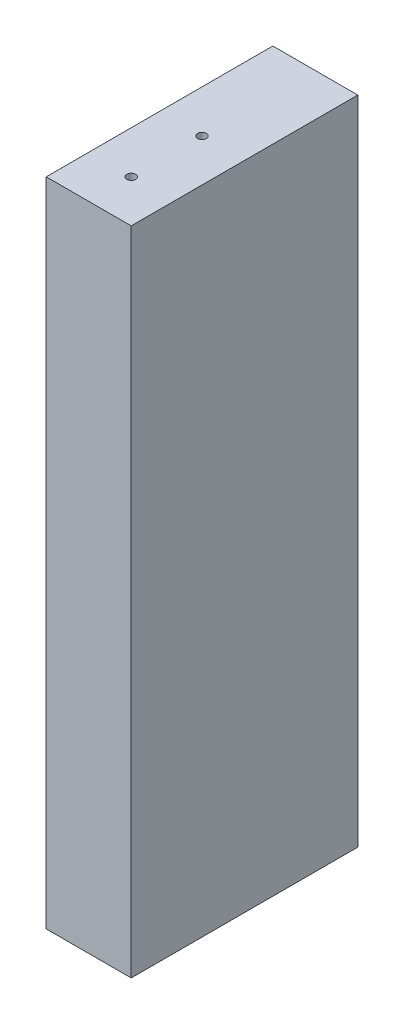
ISO-10303-21;
HEADER;
FILE_DESCRIPTION(('STEP AP214'),'2;1');
FILE_NAME('part.step','',(''),(''),'','','');
FILE_SCHEMA(('AUTOMOTIVE_DESIGN { 1 0 10303 214 1 1 1 1 }'));
ENDSEC;
DATA;
#1=APPLICATION_CONTEXT('core data for automotive mechanical design processes');
#2=APPLICATION_PROTOCOL_DEFINITION('international standard','automotive_design',2000,#1);
#3=PRODUCT_CONTEXT('',#1,'mechanical');
#4=PRODUCT('Part','Part','',(#3));
#5=PRODUCT_RELATED_PRODUCT_CATEGORY('part','',(#4));
#6=PRODUCT_DEFINITION_FORMATION('','',#4);
#7=PRODUCT_DEFINITION_CONTEXT('part definition',#1,'design');
#8=PRODUCT_DEFINITION('design','',#6,#7);
#9=PRODUCT_DEFINITION_SHAPE('','',#8);
#10=(LENGTH_UNIT() NAMED_UNIT(*) SI_UNIT(.MILLI.,.METRE.));
#11=(NAMED_UNIT(*) PLANE_ANGLE_UNIT() SI_UNIT($,.RADIAN.));
#12=(NAMED_UNIT(*) SI_UNIT($,.STERADIAN.) SOLID_ANGLE_UNIT());
#13=UNCERTAINTY_MEASURE_WITH_UNIT(LENGTH_MEASURE(1.E-05),#10,'distance_accuracy_value','');
#14=(GEOMETRIC_REPRESENTATION_CONTEXT(3) GLOBAL_UNCERTAINTY_ASSIGNED_CONTEXT((#13)) GLOBAL_UNIT_ASSIGNED_CONTEXT((#10,
#11,#12)) REPRESENTATION_CONTEXT('',''));
#15=CARTESIAN_POINT('',(0.,0.,0.));
#16=DIRECTION('',(0.,0.,1.));
#17=DIRECTION('',(1.,0.,0.));
#18=AXIS2_PLACEMENT_3D('',#15,#16,#17);
#19=CARTESIAN_POINT('',(462.706312422307,6285.23,50.8));
#20=DIRECTION('',(1.,0.,0.));
#21=DIRECTION('',(0.,0.,-1.));
#22=AXIS2_PLACEMENT_3D('',#19,#20,#21);
#23=PLANE('',#22);
#24=DIRECTION('',(0.,-1.,0.));
#25=VECTOR('',#24,1.);
#26=CARTESIAN_POINT('',(462.706312422307,6285.23,0.));
#27=LINE('',#26,#25);
#28=CARTESIAN_POINT('',(462.706312422307,6431.28,0.));
#29=VERTEX_POINT('',#28);
#30=CARTESIAN_POINT('',(462.706312422307,6285.23,0.));
#31=VERTEX_POINT('',#30);
#32=EDGE_CURVE('E147',#29,#31,#27,.T.);
#33=ORIENTED_EDGE('',*,*,#32,.T.);
#34=DIRECTION('',(0.,0.,-1.));
#35=VECTOR('',#34,1.);
#36=CARTESIAN_POINT('',(462.706312422307,6285.23,50.8));
#37=LINE('',#36,#35);
#38=CARTESIAN_POINT('',(462.706312422307,6285.23,50.8));
#39=VERTEX_POINT('',#38);
#40=EDGE_CURVE('E11',#39,#31,#37,.T.);
#41=ORIENTED_EDGE('',*,*,#40,.F.);
#42=DIRECTION('',(0.,-1.,0.));
#43=VECTOR('',#42,1.);
#44=CARTESIAN_POINT('',(462.706312422307,6285.23,50.8));
#45=LINE('',#44,#43);
#46=CARTESIAN_POINT('',(462.706312422307,6431.28,50.8));
#47=VERTEX_POINT('',#46);
#48=EDGE_CURVE('E140',#47,#39,#45,.T.);
#49=ORIENTED_EDGE('',*,*,#48,.F.);
#50=DIRECTION('',(0.,0.,-1.));
#51=VECTOR('',#50,1.);
#52=CARTESIAN_POINT('',(462.706312422307,6431.28,50.8));
#53=LINE('',#52,#51);
#54=EDGE_CURVE('E146',#47,#29,#53,.T.);
#55=ORIENTED_EDGE('',*,*,#54,.T.);
#56=EDGE_LOOP('',(#33,#41,#49,#55));
#57=FACE_BOUND('',#56,.T.);
#58=ADVANCED_FACE('F32',(#57),#23,.F.);
#59=CARTESIAN_POINT('',(462.706312422307,6285.23,50.8));
#60=DIRECTION('',(0.,1.,0.));
#61=DIRECTION('',(0.,0.,1.));
#62=AXIS2_PLACEMENT_3D('',#59,#60,#61);
#63=PLANE('',#62);
#64=CARTESIAN_POINT('',(472.231312422307,6285.23,25.4));
#65=DIRECTION('',(0.,-1.,0.));
#66=DIRECTION('',(0.,0.,-1.));
#67=AXIS2_PLACEMENT_3D('',#64,#65,#66);
#68=CIRCLE('',#67,0.992251);
#69=CARTESIAN_POINT('',(472.231312422307,6285.23,24.407749));
#70=VERTEX_POINT('',#69);
#71=EDGE_CURVE('E111',#70,#70,#68,.T.);
#72=ORIENTED_EDGE('',*,*,#71,.F.);
#73=EDGE_LOOP('',(#72));
#74=FACE_BOUND('',#73,.T.);
#75=CARTESIAN_POINT('',(472.231312422307,6285.23,41.275));
#76=DIRECTION('',(0.,-1.,0.));
#77=DIRECTION('',(0.,0.,-1.));
#78=AXIS2_PLACEMENT_3D('',#75,#76,#77);
#79=CIRCLE('',#78,0.992251);
#80=CARTESIAN_POINT('',(472.231312422307,6285.23,40.282749));
#81=VERTEX_POINT('',#80);
#82=EDGE_CURVE('E110',#81,#81,#79,.T.);
#83=ORIENTED_EDGE('',*,*,#82,.F.);
#84=EDGE_LOOP('',(#83));
#85=FACE_BOUND('',#84,.T.);
#86=DIRECTION('',(1.,0.,0.));
#87=VECTOR('',#86,1.);
#88=CARTESIAN_POINT('',(462.706312422307,6285.23,0.));
#89=LINE('',#88,#87);
#90=CARTESIAN_POINT('',(481.756312422307,6285.23,0.));
#91=VERTEX_POINT('',#90);
#92=EDGE_CURVE('E150',#31,#91,#89,.T.);
#93=ORIENTED_EDGE('',*,*,#92,.T.);
#94=DIRECTION('',(0.,0.,-1.));
#95=VECTOR('',#94,1.);
#96=CARTESIAN_POINT('',(481.756312422307,6285.23,50.8));
#97=LINE('',#96,#95);
#98=CARTESIAN_POINT('',(481.756312422307,6285.23,50.8));
#99=VERTEX_POINT('',#98);
#100=EDGE_CURVE('E41',#99,#91,#97,.T.);
#101=ORIENTED_EDGE('',*,*,#100,.F.);
#102=DIRECTION('',(1.,0.,0.));
#103=VECTOR('',#102,1.);
#104=CARTESIAN_POINT('',(462.706312422307,6285.23,50.8));
#105=LINE('',#104,#103);
#106=EDGE_CURVE('E81',#39,#99,#105,.T.);
#107=ORIENTED_EDGE('',*,*,#106,.F.);
#108=ORIENTED_EDGE('',*,*,#40,.T.);
#109=EDGE_LOOP('',(#93,#101,#107,#108));
#110=FACE_BOUND('',#109,.T.);
#111=ADVANCED_FACE('F177',(#74,#85,#110),#63,.F.);
#112=CARTESIAN_POINT('',(481.756312422307,6285.23,50.8));
#113=DIRECTION('',(-1.,0.,0.));
#114=DIRECTION('',(0.,0.,1.));
#115=AXIS2_PLACEMENT_3D('',#112,#113,#114);
#116=PLANE('',#115);
#117=DIRECTION('',(0.,1.,0.));
#118=VECTOR('',#117,1.);
#119=CARTESIAN_POINT('',(481.756312422307,6285.23,0.));
#120=LINE('',#119,#118);
#121=CARTESIAN_POINT('',(481.756312422307,6431.28,0.));
#122=VERTEX_POINT('',#121);
#123=EDGE_CURVE('E68',#91,#122,#120,.T.);
#124=ORIENTED_EDGE('',*,*,#123,.T.);
#125=DIRECTION('',(0.,0.,-1.));
#126=VECTOR('',#125,1.);
#127=CARTESIAN_POINT('',(481.756312422307,6431.28,50.8));
#128=LINE('',#127,#126);
#129=CARTESIAN_POINT('',(481.756312422307,6431.28,50.8));
#130=VERTEX_POINT('',#129);
#131=EDGE_CURVE('E155',#130,#122,#128,.T.);
#132=ORIENTED_EDGE('',*,*,#131,.F.);
#133=DIRECTION('',(0.,1.,0.));
#134=VECTOR('',#133,1.);
#135=CARTESIAN_POINT('',(481.756312422307,6285.23,50.8));
#136=LINE('',#135,#134);
#137=EDGE_CURVE('E143',#99,#130,#136,.T.);
#138=ORIENTED_EDGE('',*,*,#137,.F.);
#139=ORIENTED_EDGE('',*,*,#100,.T.);
#140=EDGE_LOOP('',(#124,#132,#138,#139));
#141=FACE_BOUND('',#140,.T.);
#142=ADVANCED_FACE('F176',(#141),#116,.F.);
#143=CARTESIAN_POINT('',(462.706312422307,6431.28,50.8));
#144=DIRECTION('',(0.,-1.,0.));
#145=DIRECTION('',(0.,0.,-1.));
#146=AXIS2_PLACEMENT_3D('',#143,#144,#145);
#147=PLANE('',#146);
#148=CARTESIAN_POINT('',(472.231312422307,6431.28,25.4));
#149=DIRECTION('',(0.,1.,0.));
#150=DIRECTION('',(0.,0.,1.));
#151=AXIS2_PLACEMENT_3D('',#148,#149,#150);
#152=CIRCLE('',#151,0.992251);
#153=CARTESIAN_POINT('',(472.231312422307,6431.28,26.392251));
#154=VERTEX_POINT('',#153);
#155=EDGE_CURVE('E121',#154,#154,#152,.T.);
#156=ORIENTED_EDGE('',*,*,#155,.F.);
#157=EDGE_LOOP('',(#156));
#158=FACE_BOUND('',#157,.T.);
#159=CARTESIAN_POINT('',(472.231312422307,6431.28,41.275));
#160=DIRECTION('',(0.,1.,0.));
#161=DIRECTION('',(0.,0.,1.));
#162=AXIS2_PLACEMENT_3D('',#159,#160,#161);
#163=CIRCLE('',#162,0.992251);
#164=CARTESIAN_POINT('',(472.231312422307,6431.28,42.267251));
#165=VERTEX_POINT('',#164);
#166=EDGE_CURVE('E127',#165,#165,#163,.T.);
#167=ORIENTED_EDGE('',*,*,#166,.F.);
#168=EDGE_LOOP('',(#167));
#169=FACE_BOUND('',#168,.T.);
#170=DIRECTION('',(-1.,0.,0.));
#171=VECTOR('',#170,1.);
#172=CARTESIAN_POINT('',(462.706312422307,6431.28,0.));
#173=LINE('',#172,#171);
#174=EDGE_CURVE('E74',#122,#29,#173,.T.);
#175=ORIENTED_EDGE('',*,*,#174,.T.);
#176=ORIENTED_EDGE('',*,*,#54,.F.);
#177=DIRECTION('',(-1.,0.,0.));
#178=VECTOR('',#177,1.);
#179=CARTESIAN_POINT('',(462.706312422307,6431.28,50.8));
#180=LINE('',#179,#178);
#181=EDGE_CURVE('E50',#130,#47,#180,.T.);
#182=ORIENTED_EDGE('',*,*,#181,.F.);
#183=ORIENTED_EDGE('',*,*,#131,.T.);
#184=EDGE_LOOP('',(#175,#176,#182,#183));
#185=FACE_BOUND('',#184,.T.);
#186=ADVANCED_FACE('F174',(#158,#169,#185),#147,.F.);
#187=CARTESIAN_POINT('',(0.,0.,50.8));
#188=DIRECTION('',(0.,0.,-1.));
#189=DIRECTION('',(-1.,0.,0.));
#190=AXIS2_PLACEMENT_3D('',#187,#188,#189);
#191=PLANE('',#190);
#192=ORIENTED_EDGE('',*,*,#48,.T.);
#193=ORIENTED_EDGE('',*,*,#106,.T.);
#194=ORIENTED_EDGE('',*,*,#137,.T.);
#195=ORIENTED_EDGE('',*,*,#181,.T.);
#196=EDGE_LOOP('',(#192,#193,#194,#195));
#197=FACE_BOUND('',#196,.T.);
#198=ADVANCED_FACE('F167',(#197),#191,.F.);
#199=CARTESIAN_POINT('',(0.,0.,0.));
#200=DIRECTION('',(0.,0.,-1.));
#201=DIRECTION('',(-1.,0.,0.));
#202=AXIS2_PLACEMENT_3D('',#199,#200,#201);
#203=PLANE('',#202);
#204=CARTESIAN_POINT('',(472.231312422307,6396.355,0.));
#205=DIRECTION('',(0.,0.,-1.));
#206=DIRECTION('',(-1.,0.,0.));
#207=AXIS2_PLACEMENT_3D('',#204,#205,#206);
#208=CIRCLE('',#207,0.992251);
#209=CARTESIAN_POINT('',(471.239061422307,6396.355,0.));
#210=VERTEX_POINT('',#209);
#211=EDGE_CURVE('E35',#210,#210,#208,.T.);
#212=ORIENTED_EDGE('',*,*,#211,.F.);
#213=EDGE_LOOP('',(#212));
#214=FACE_BOUND('',#213,.T.);
#215=CARTESIAN_POINT('',(472.231312422307,6320.155,0.));
#216=DIRECTION('',(0.,0.,-1.));
#217=DIRECTION('',(-1.,0.,0.));
#218=AXIS2_PLACEMENT_3D('',#215,#216,#217);
#219=CIRCLE('',#218,0.992251);
#220=CARTESIAN_POINT('',(471.239061422307,6320.155,0.));
#221=VERTEX_POINT('',#220);
#222=EDGE_CURVE('E139',#221,#221,#219,.T.);
#223=ORIENTED_EDGE('',*,*,#222,.F.);
#224=EDGE_LOOP('',(#223));
#225=FACE_BOUND('',#224,.T.);
#226=ORIENTED_EDGE('',*,*,#32,.F.);
#227=ORIENTED_EDGE('',*,*,#174,.F.);
#228=ORIENTED_EDGE('',*,*,#123,.F.);
#229=ORIENTED_EDGE('',*,*,#92,.F.);
#230=EDGE_LOOP('',(#226,#227,#228,#229));
#231=FACE_BOUND('',#230,.T.);
#232=ADVANCED_FACE('F163',(#214,#225,#231),#203,.T.);
#233=CARTESIAN_POINT('',(472.231312422307,6320.15499998369,19.0498931991422));
#234=DIRECTION('',(0.,8.55995509861818E-10,-1.));
#235=DIRECTION('',(0.,1.,8.55995509861818E-10));
#236=AXIS2_PLACEMENT_3D('',#233,#234,#235);
#237=CONICAL_SURFACE('',#236,0.992251,1.02974425867666);
#238=CARTESIAN_POINT('',(472.231312422307,6320.15499998318,19.6460977492329));
#239=VERTEX_POINT('',#238);
#240=VERTEX_LOOP('',#239);
#241=FACE_BOUND('',#240,.T.);
#242=CARTESIAN_POINT('',(472.231312422307,6320.15499998369,19.0498931991422));
#243=DIRECTION('',(0.,8.55995509861818E-10,-1.));
#244=DIRECTION('',(0.,1.,8.55995509861818E-10));
#245=AXIS2_PLACEMENT_3D('',#242,#243,#244);
#246=CIRCLE('',#245,0.992251);
#247=CARTESIAN_POINT('',(472.231312422307,6321.14725098369,19.0498931999915));
#248=VERTEX_POINT('',#247);
#249=EDGE_CURVE('E136',#248,#248,#246,.T.);
#250=ORIENTED_EDGE('',*,*,#249,.T.);
#251=EDGE_LOOP('',(#250));
#252=FACE_BOUND('',#251,.T.);
#253=ADVANCED_FACE('F166',(#241,#252),#237,.F.);
#254=CARTESIAN_POINT('',(472.231312422307,6320.15500001631,-19.0501068008578));
#255=DIRECTION('',(0.,8.55995509861818E-10,-1.));
#256=DIRECTION('',(0.,1.,8.55995509861818E-10));
#257=AXIS2_PLACEMENT_3D('',#254,#255,#256);
#258=CYLINDRICAL_SURFACE('',#257,0.992251);
#259=ORIENTED_EDGE('',*,*,#222,.T.);
#260=EDGE_LOOP('',(#259));
#261=FACE_BOUND('',#260,.T.);
#262=ORIENTED_EDGE('',*,*,#249,.F.);
#263=EDGE_LOOP('',(#262));
#264=FACE_BOUND('',#263,.T.);
#265=ADVANCED_FACE('F160',(#261,#264),#258,.F.);
#266=CARTESIAN_POINT('',(472.231312422307,6396.35499998369,19.049893264369));
#267=DIRECTION('',(0.,8.55995509861818E-10,-1.));
#268=DIRECTION('',(0.,1.,8.55995509861818E-10));
#269=AXIS2_PLACEMENT_3D('',#266,#267,#268);
#270=CONICAL_SURFACE('',#269,0.992251,1.02974425867666);
#271=CARTESIAN_POINT('',(472.231312422307,6396.35499998318,19.6460978144597));
#272=VERTEX_POINT('',#271);
#273=VERTEX_LOOP('',#272);
#274=FACE_BOUND('',#273,.T.);
#275=CARTESIAN_POINT('',(472.231312422307,6396.35499998369,19.049893264369));
#276=DIRECTION('',(0.,8.55995509861818E-10,-1.));
#277=DIRECTION('',(0.,1.,8.55995509861818E-10));
#278=AXIS2_PLACEMENT_3D('',#275,#276,#277);
#279=CIRCLE('',#278,0.992251);
#280=CARTESIAN_POINT('',(472.231312422307,6397.34725098369,19.0498932652184));
#281=VERTEX_POINT('',#280);
#282=EDGE_CURVE('E133',#281,#281,#279,.T.);
#283=ORIENTED_EDGE('',*,*,#282,.T.);
#284=EDGE_LOOP('',(#283));
#285=FACE_BOUND('',#284,.T.);
#286=ADVANCED_FACE('F198',(#274,#285),#270,.F.);
#287=CARTESIAN_POINT('',(472.231312422307,6396.35500001631,-19.050106735631));
#288=DIRECTION('',(0.,8.55995509861818E-10,-1.));
#289=DIRECTION('',(0.,1.,8.55995509861818E-10));
#290=AXIS2_PLACEMENT_3D('',#287,#288,#289);
#291=CYLINDRICAL_SURFACE('',#290,0.992251);
#292=ORIENTED_EDGE('',*,*,#211,.T.);
#293=EDGE_LOOP('',(#292));
#294=FACE_BOUND('',#293,.T.);
#295=ORIENTED_EDGE('',*,*,#282,.F.);
#296=EDGE_LOOP('',(#295));
#297=FACE_BOUND('',#296,.T.);
#298=ADVANCED_FACE('F201',(#294,#297),#291,.F.);
#299=CARTESIAN_POINT('',(472.231312422307,6412.23,41.275));
#300=DIRECTION('',(0.,1.,0.));
#301=DIRECTION('',(0.,0.,1.));
#302=AXIS2_PLACEMENT_3D('',#299,#300,#301);
#303=CONICAL_SURFACE('',#302,0.992251,1.02974425867684);
#304=CARTESIAN_POINT('',(472.231312422307,6411.63379544991,41.275));
#305=VERTEX_POINT('',#304);
#306=VERTEX_LOOP('',#305);
#307=FACE_BOUND('',#306,.T.);
#308=CARTESIAN_POINT('',(472.231312422307,6412.23,41.275));
#309=DIRECTION('',(0.,1.,0.));
#310=DIRECTION('',(0.,0.,1.));
#311=AXIS2_PLACEMENT_3D('',#308,#309,#310);
#312=CIRCLE('',#311,0.992251);
#313=CARTESIAN_POINT('',(472.231312422307,6412.23,42.267251));
#314=VERTEX_POINT('',#313);
#315=EDGE_CURVE('E130',#314,#314,#312,.T.);
#316=ORIENTED_EDGE('',*,*,#315,.T.);
#317=EDGE_LOOP('',(#316));
#318=FACE_BOUND('',#317,.T.);
#319=ADVANCED_FACE('F205',(#307,#318),#303,.F.);
#320=CARTESIAN_POINT('',(472.231312422307,6431.28,41.275));
#321=DIRECTION('',(0.,1.,0.));
#322=DIRECTION('',(0.,0.,1.));
#323=AXIS2_PLACEMENT_3D('',#320,#321,#322);
#324=CYLINDRICAL_SURFACE('',#323,0.992251);
#325=ORIENTED_EDGE('',*,*,#315,.F.);
#326=EDGE_LOOP('',(#325));
#327=FACE_BOUND('',#326,.T.);
#328=ORIENTED_EDGE('',*,*,#166,.T.);
#329=EDGE_LOOP('',(#328));
#330=FACE_BOUND('',#329,.T.);
#331=ADVANCED_FACE('F209',(#327,#330),#324,.F.);
#332=CARTESIAN_POINT('',(472.231312422307,6412.23,25.4));
#333=DIRECTION('',(0.,1.,0.));
#334=DIRECTION('',(0.,0.,1.));
#335=AXIS2_PLACEMENT_3D('',#332,#333,#334);
#336=CONICAL_SURFACE('',#335,0.992251,1.02974425867684);
#337=CARTESIAN_POINT('',(472.231312422307,6411.63379544991,25.4));
#338=VERTEX_POINT('',#337);
#339=VERTEX_LOOP('',#338);
#340=FACE_BOUND('',#339,.T.);
#341=CARTESIAN_POINT('',(472.231312422307,6412.23,25.4));
#342=DIRECTION('',(0.,1.,0.));
#343=DIRECTION('',(0.,0.,1.));
#344=AXIS2_PLACEMENT_3D('',#341,#342,#343);
#345=CIRCLE('',#344,0.992251);
#346=CARTESIAN_POINT('',(472.231312422307,6412.23,26.392251));
#347=VERTEX_POINT('',#346);
#348=EDGE_CURVE('E124',#347,#347,#345,.T.);
#349=ORIENTED_EDGE('',*,*,#348,.T.);
#350=EDGE_LOOP('',(#349));
#351=FACE_BOUND('',#350,.T.);
#352=ADVANCED_FACE('F213',(#340,#351),#336,.F.);
#353=CARTESIAN_POINT('',(472.231312422307,6431.28,25.4));
#354=DIRECTION('',(0.,1.,0.));
#355=DIRECTION('',(0.,0.,1.));
#356=AXIS2_PLACEMENT_3D('',#353,#354,#355);
#357=CYLINDRICAL_SURFACE('',#356,0.992251);
#358=ORIENTED_EDGE('',*,*,#348,.F.);
#359=EDGE_LOOP('',(#358));
#360=FACE_BOUND('',#359,.T.);
#361=ORIENTED_EDGE('',*,*,#155,.T.);
#362=EDGE_LOOP('',(#361));
#363=FACE_BOUND('',#362,.T.);
#364=ADVANCED_FACE('F217',(#360,#363),#357,.F.);
#365=CARTESIAN_POINT('',(472.231312422307,6304.28,41.275));
#366=DIRECTION('',(0.,-1.,0.));
#367=DIRECTION('',(0.,0.,-1.));
#368=AXIS2_PLACEMENT_3D('',#365,#366,#367);
#369=CONICAL_SURFACE('',#368,0.992251,1.02974425867684);
#370=CARTESIAN_POINT('',(472.231312422307,6304.87620455009,41.275));
#371=VERTEX_POINT('',#370);
#372=VERTEX_LOOP('',#371);
#373=FACE_BOUND('',#372,.T.);
#374=CARTESIAN_POINT('',(472.231312422307,6304.28,41.275));
#375=DIRECTION('',(0.,-1.,0.));
#376=DIRECTION('',(0.,0.,-1.));
#377=AXIS2_PLACEMENT_3D('',#374,#375,#376);
#378=CIRCLE('',#377,0.992251);
#379=CARTESIAN_POINT('',(472.231312422307,6304.28,40.282749));
#380=VERTEX_POINT('',#379);
#381=EDGE_CURVE('E114',#380,#380,#378,.T.);
#382=ORIENTED_EDGE('',*,*,#381,.T.);
#383=EDGE_LOOP('',(#382));
#384=FACE_BOUND('',#383,.T.);
#385=ADVANCED_FACE('F221',(#373,#384),#369,.F.);
#386=CARTESIAN_POINT('',(472.231312422307,6285.23,41.275));
#387=DIRECTION('',(0.,-1.,0.));
#388=DIRECTION('',(0.,0.,-1.));
#389=AXIS2_PLACEMENT_3D('',#386,#387,#388);
#390=CYLINDRICAL_SURFACE('',#389,0.992251);
#391=ORIENTED_EDGE('',*,*,#381,.F.);
#392=EDGE_LOOP('',(#391));
#393=FACE_BOUND('',#392,.T.);
#394=ORIENTED_EDGE('',*,*,#82,.T.);
#395=EDGE_LOOP('',(#394));
#396=FACE_BOUND('',#395,.T.);
#397=ADVANCED_FACE('F104',(#393,#396),#390,.F.);
#398=CARTESIAN_POINT('',(472.231312422307,6304.28,25.4));
#399=DIRECTION('',(0.,-1.,0.));
#400=DIRECTION('',(0.,0.,-1.));
#401=AXIS2_PLACEMENT_3D('',#398,#399,#400);
#402=CONICAL_SURFACE('',#401,0.992251,1.02974425867684);
#403=CARTESIAN_POINT('',(472.231312422307,6304.87620455009,25.4));
#404=VERTEX_POINT('',#403);
#405=VERTEX_LOOP('',#404);
#406=FACE_BOUND('',#405,.T.);
#407=CARTESIAN_POINT('',(472.231312422307,6304.28,25.4));
#408=DIRECTION('',(0.,-1.,0.));
#409=DIRECTION('',(0.,0.,-1.));
#410=AXIS2_PLACEMENT_3D('',#407,#408,#409);
#411=CIRCLE('',#410,0.992251);
#412=CARTESIAN_POINT('',(472.231312422307,6304.28,24.407749));
#413=VERTEX_POINT('',#412);
#414=EDGE_CURVE('E108',#413,#413,#411,.T.);
#415=ORIENTED_EDGE('',*,*,#414,.T.);
#416=EDGE_LOOP('',(#415));
#417=FACE_BOUND('',#416,.T.);
#418=ADVANCED_FACE('F100',(#406,#417),#402,.F.);
#419=CARTESIAN_POINT('',(472.231312422307,6285.23,25.4));
#420=DIRECTION('',(0.,-1.,0.));
#421=DIRECTION('',(0.,0.,-1.));
#422=AXIS2_PLACEMENT_3D('',#419,#420,#421);
#423=CYLINDRICAL_SURFACE('',#422,0.992251);
#424=ORIENTED_EDGE('',*,*,#414,.F.);
#425=EDGE_LOOP('',(#424));
#426=FACE_BOUND('',#425,.T.);
#427=ORIENTED_EDGE('',*,*,#71,.T.);
#428=EDGE_LOOP('',(#427));
#429=FACE_BOUND('',#428,.T.);
#430=ADVANCED_FACE('F103',(#426,#429),#423,.F.);
#431=CLOSED_SHELL('',(#58,#111,#142,#186,#198,#232,#253,#265,#286,#298,#319,#331,#352,#364,#385,
#397,#418,#430));
#432=MANIFOLD_SOLID_BREP('B2',#431);
#433=ADVANCED_BREP_SHAPE_REPRESENTATION('',(#18,#432),#14);
#434=SHAPE_DEFINITION_REPRESENTATION(#9,#433);
ENDSEC;
END-ISO-10303-21;
